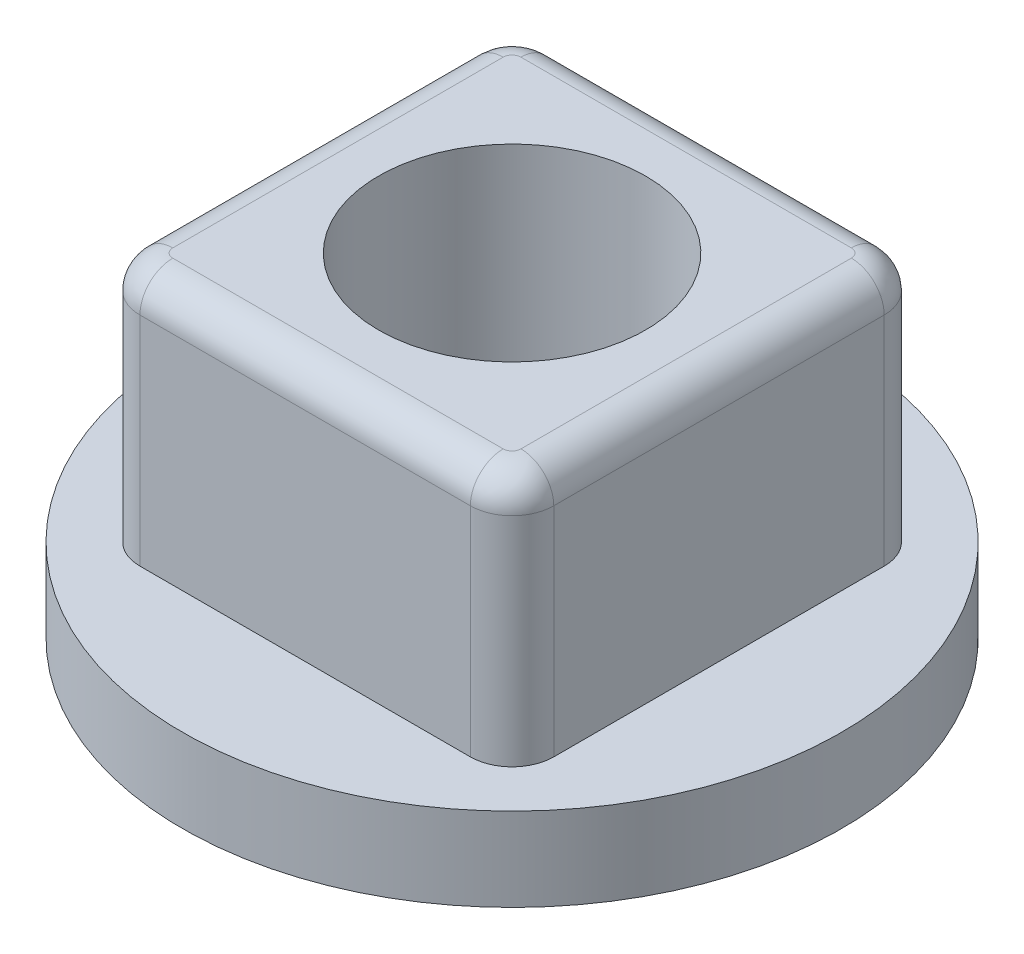
ISO-10303-21;
HEADER;
FILE_DESCRIPTION(('STEP AP214'),'2;1');
FILE_NAME('part.step','',(''),(''),'','','');
FILE_SCHEMA(('AUTOMOTIVE_DESIGN { 1 0 10303 214 1 1 1 1 }'));
ENDSEC;
DATA;
#1=APPLICATION_CONTEXT('core data for automotive mechanical design processes');
#2=APPLICATION_PROTOCOL_DEFINITION('international standard','automotive_design',2000,#1);
#3=PRODUCT_CONTEXT('',#1,'mechanical');
#4=PRODUCT('Part','Part','',(#3));
#5=PRODUCT_RELATED_PRODUCT_CATEGORY('part','',(#4));
#6=PRODUCT_DEFINITION_FORMATION('','',#4);
#7=PRODUCT_DEFINITION_CONTEXT('part definition',#1,'design');
#8=PRODUCT_DEFINITION('design','',#6,#7);
#9=PRODUCT_DEFINITION_SHAPE('','',#8);
#10=(LENGTH_UNIT() NAMED_UNIT(*) SI_UNIT(.MILLI.,.METRE.));
#11=(NAMED_UNIT(*) PLANE_ANGLE_UNIT() SI_UNIT($,.RADIAN.));
#12=(NAMED_UNIT(*) SI_UNIT($,.STERADIAN.) SOLID_ANGLE_UNIT());
#13=UNCERTAINTY_MEASURE_WITH_UNIT(LENGTH_MEASURE(1.E-05),#10,'distance_accuracy_value','');
#14=(GEOMETRIC_REPRESENTATION_CONTEXT(3) GLOBAL_UNCERTAINTY_ASSIGNED_CONTEXT((#13)) GLOBAL_UNIT_ASSIGNED_CONTEXT((#10,
#11,#12)) REPRESENTATION_CONTEXT('',''));
#15=CARTESIAN_POINT('',(0.,0.,0.));
#16=DIRECTION('',(0.,0.,1.));
#17=DIRECTION('',(1.,0.,0.));
#18=AXIS2_PLACEMENT_3D('',#15,#16,#17);
#19=CARTESIAN_POINT('',(-2.5146,5.08,2.5146));
#20=DIRECTION('',(0.,-1.,0.));
#21=DIRECTION('',(0.,0.,-1.));
#22=AXIS2_PLACEMENT_3D('',#19,#20,#21);
#23=CYLINDRICAL_SURFACE('',#22,0.635);
#24=DIRECTION('',(0.,1.,0.));
#25=VECTOR('',#24,1.);
#26=CARTESIAN_POINT('',(-3.1496,5.08,2.51459999999995));
#27=LINE('',#26,#25);
#28=CARTESIAN_POINT('',(-3.14960000000036,4.58,2.51460000000302));
#29=VERTEX_POINT('',#28);
#30=CARTESIAN_POINT('',(-3.1496,1.27,2.51459999999997));
#31=VERTEX_POINT('',#30);
#32=EDGE_CURVE('E65',#29,#31,#27,.F.);
#33=ORIENTED_EDGE('',*,*,#32,.T.);
#34=CARTESIAN_POINT('',(-2.5146,1.27,2.5146));
#35=DIRECTION('',(0.,-1.,0.));
#36=DIRECTION('',(0.,0.,-1.));
#37=AXIS2_PLACEMENT_3D('',#34,#35,#36);
#38=CIRCLE('',#37,0.635);
#39=CARTESIAN_POINT('',(-2.5146,1.27,3.1496));
#40=VERTEX_POINT('',#39);
#41=EDGE_CURVE('E17',#31,#40,#38,.F.);
#42=ORIENTED_EDGE('',*,*,#41,.T.);
#43=DIRECTION('',(0.,1.,0.));
#44=VECTOR('',#43,1.);
#45=CARTESIAN_POINT('',(-2.5146,5.08,3.1496));
#46=LINE('',#45,#44);
#47=CARTESIAN_POINT('',(-2.5146,4.58,3.14959999999967));
#48=VERTEX_POINT('',#47);
#49=EDGE_CURVE('E62',#40,#48,#46,.T.);
#50=ORIENTED_EDGE('',*,*,#49,.T.);
#51=CARTESIAN_POINT('',(-2.51460000000003,4.58000000000001,2.51459999999865));
#52=DIRECTION('',(0.,-1.,0.));
#53=DIRECTION('',(0.,0.,-1.));
#54=AXIS2_PLACEMENT_3D('',#51,#52,#53);
#55=CIRCLE('',#54,0.635000000000685);
#56=EDGE_CURVE('E214',#29,#48,#55,.F.);
#57=ORIENTED_EDGE('',*,*,#56,.F.);
#58=EDGE_LOOP('',(#33,#42,#50,#57));
#59=FACE_BOUND('',#58,.T.);
#60=ADVANCED_FACE('F14',(#59),#23,.T.);
#61=CARTESIAN_POINT('',(-2.5146,5.08,-2.5146));
#62=DIRECTION('',(0.,-1.,0.));
#63=DIRECTION('',(0.,0.,-1.));
#64=AXIS2_PLACEMENT_3D('',#61,#62,#63);
#65=CYLINDRICAL_SURFACE('',#64,0.635);
#66=DIRECTION('',(0.,1.,0.));
#67=VECTOR('',#66,1.);
#68=CARTESIAN_POINT('',(-2.51459999999995,5.08,-3.1496));
#69=LINE('',#68,#67);
#70=CARTESIAN_POINT('',(-2.51460000000237,4.58000000000076,-3.1496));
#71=VERTEX_POINT('',#70);
#72=CARTESIAN_POINT('',(-2.51459999999997,1.27,-3.1496));
#73=VERTEX_POINT('',#72);
#74=EDGE_CURVE('E182',#71,#73,#69,.F.);
#75=ORIENTED_EDGE('',*,*,#74,.T.);
#76=CARTESIAN_POINT('',(-2.5146,1.27,-2.5146));
#77=DIRECTION('',(0.,-1.,0.));
#78=DIRECTION('',(0.,0.,-1.));
#79=AXIS2_PLACEMENT_3D('',#76,#77,#78);
#80=CIRCLE('',#79,0.635);
#81=CARTESIAN_POINT('',(-3.1496,1.27,-2.5146));
#82=VERTEX_POINT('',#81);
#83=EDGE_CURVE('E67',#73,#82,#80,.F.);
#84=ORIENTED_EDGE('',*,*,#83,.T.);
#85=DIRECTION('',(0.,1.,0.));
#86=VECTOR('',#85,1.);
#87=CARTESIAN_POINT('',(-3.1496,5.08,-2.5146));
#88=LINE('',#87,#86);
#89=CARTESIAN_POINT('',(-3.14959999999983,4.58,-2.5146));
#90=VERTEX_POINT('',#89);
#91=EDGE_CURVE('E189',#82,#90,#88,.T.);
#92=ORIENTED_EDGE('',*,*,#91,.T.);
#93=CARTESIAN_POINT('',(-2.51459999999865,4.58000000000001,-2.51460000000003));
#94=DIRECTION('',(0.,-1.,0.));
#95=DIRECTION('',(1.,0.,0.));
#96=AXIS2_PLACEMENT_3D('',#93,#94,#95);
#97=CIRCLE('',#96,0.635000000000685);
#98=EDGE_CURVE('E224',#71,#90,#97,.F.);
#99=ORIENTED_EDGE('',*,*,#98,.F.);
#100=EDGE_LOOP('',(#75,#84,#92,#99));
#101=FACE_BOUND('',#100,.T.);
#102=ADVANCED_FACE('F335',(#101),#65,.T.);
#103=CARTESIAN_POINT('',(2.5146,5.08,2.5146));
#104=DIRECTION('',(0.,-1.,0.));
#105=DIRECTION('',(0.,0.,-1.));
#106=AXIS2_PLACEMENT_3D('',#103,#104,#105);
#107=CYLINDRICAL_SURFACE('',#106,0.635);
#108=DIRECTION('',(0.,1.,0.));
#109=VECTOR('',#108,1.);
#110=CARTESIAN_POINT('',(2.51459999999995,5.08,3.1496));
#111=LINE('',#110,#109);
#112=CARTESIAN_POINT('',(2.51460000000302,4.58,3.14960000000036));
#113=VERTEX_POINT('',#112);
#114=CARTESIAN_POINT('',(2.51459999999997,1.27,3.1496));
#115=VERTEX_POINT('',#114);
#116=EDGE_CURVE('E192',#113,#115,#111,.F.);
#117=ORIENTED_EDGE('',*,*,#116,.T.);
#118=CARTESIAN_POINT('',(2.5146,1.27,2.5146));
#119=DIRECTION('',(0.,-1.,0.));
#120=DIRECTION('',(0.,0.,-1.));
#121=AXIS2_PLACEMENT_3D('',#118,#119,#120);
#122=CIRCLE('',#121,0.635);
#123=CARTESIAN_POINT('',(3.1496,1.27,2.5146));
#124=VERTEX_POINT('',#123);
#125=EDGE_CURVE('E79',#115,#124,#122,.F.);
#126=ORIENTED_EDGE('',*,*,#125,.T.);
#127=DIRECTION('',(0.,1.,0.));
#128=VECTOR('',#127,1.);
#129=CARTESIAN_POINT('',(3.1496,5.08,2.5146));
#130=LINE('',#129,#128);
#131=CARTESIAN_POINT('',(3.14959999999983,4.58,2.51460000000015));
#132=VERTEX_POINT('',#131);
#133=EDGE_CURVE('E179',#124,#132,#130,.T.);
#134=ORIENTED_EDGE('',*,*,#133,.T.);
#135=CARTESIAN_POINT('',(2.51459999999865,4.58000000000001,2.51460000000003));
#136=DIRECTION('',(0.,-1.,0.));
#137=DIRECTION('',(1.,0.,0.));
#138=AXIS2_PLACEMENT_3D('',#135,#136,#137);
#139=CIRCLE('',#138,0.635000000000685);
#140=EDGE_CURVE('E283',#113,#132,#139,.F.);
#141=ORIENTED_EDGE('',*,*,#140,.F.);
#142=EDGE_LOOP('',(#117,#126,#134,#141));
#143=FACE_BOUND('',#142,.T.);
#144=ADVANCED_FACE('F366',(#143),#107,.T.);
#145=CARTESIAN_POINT('',(2.5146,5.08,-2.5146));
#146=DIRECTION('',(0.,-1.,0.));
#147=DIRECTION('',(0.,0.,-1.));
#148=AXIS2_PLACEMENT_3D('',#145,#146,#147);
#149=CYLINDRICAL_SURFACE('',#148,0.635);
#150=DIRECTION('',(0.,1.,0.));
#151=VECTOR('',#150,1.);
#152=CARTESIAN_POINT('',(3.1496,5.08,-2.51459999999997));
#153=LINE('',#152,#151);
#154=CARTESIAN_POINT('',(3.14960000000036,4.58,-2.51460000000303));
#155=VERTEX_POINT('',#154);
#156=CARTESIAN_POINT('',(3.1496,1.27,-2.51459999999999));
#157=VERTEX_POINT('',#156);
#158=EDGE_CURVE('E168',#155,#157,#153,.F.);
#159=ORIENTED_EDGE('',*,*,#158,.T.);
#160=CARTESIAN_POINT('',(2.5146,1.27,-2.5146));
#161=DIRECTION('',(0.,-1.,0.));
#162=DIRECTION('',(0.,0.,-1.));
#163=AXIS2_PLACEMENT_3D('',#160,#161,#162);
#164=CIRCLE('',#163,0.635);
#165=CARTESIAN_POINT('',(2.5146,1.27,-3.1496));
#166=VERTEX_POINT('',#165);
#167=EDGE_CURVE('E32',#157,#166,#164,.F.);
#168=ORIENTED_EDGE('',*,*,#167,.T.);
#169=DIRECTION('',(0.,1.,0.));
#170=VECTOR('',#169,1.);
#171=CARTESIAN_POINT('',(2.5146,5.08,-3.1496));
#172=LINE('',#171,#170);
#173=CARTESIAN_POINT('',(2.51460000000001,4.58,-3.14959999999983));
#174=VERTEX_POINT('',#173);
#175=EDGE_CURVE('E183',#166,#174,#172,.T.);
#176=ORIENTED_EDGE('',*,*,#175,.T.);
#177=CARTESIAN_POINT('',(2.51460000000003,4.58000000000001,-2.51459999999865));
#178=DIRECTION('',(0.,-1.,0.));
#179=DIRECTION('',(0.,0.,-1.));
#180=AXIS2_PLACEMENT_3D('',#177,#178,#179);
#181=CIRCLE('',#180,0.635000000000685);
#182=EDGE_CURVE('E253',#155,#174,#181,.F.);
#183=ORIENTED_EDGE('',*,*,#182,.F.);
#184=EDGE_LOOP('',(#159,#168,#176,#183));
#185=FACE_BOUND('',#184,.T.);
#186=ADVANCED_FACE('F379',(#185),#149,.T.);
#187=CARTESIAN_POINT('',(2.538898108304,4.58,2.6496));
#188=DIRECTION('',(-1.,0.,0.));
#189=DIRECTION('',(0.,0.,1.));
#190=AXIS2_PLACEMENT_3D('',#187,#188,#189);
#191=CYLINDRICAL_SURFACE('',#190,0.5);
#192=CARTESIAN_POINT('',(2.51460000000023,4.58000000000151,2.64960000000213));
#193=DIRECTION('',(-1.,0.,1.17253486400112E-11));
#194=DIRECTION('',(1.17253486400112E-11,0.,1.));
#195=AXIS2_PLACEMENT_3D('',#192,#193,#194);
#196=CIRCLE('',#195,0.499999999998586);
#197=CARTESIAN_POINT('',(2.51460000000024,5.08000000000005,2.64959999798593));
#198=VERTEX_POINT('',#197);
#199=EDGE_CURVE('E167',#198,#113,#196,.F.);
#200=ORIENTED_EDGE('',*,*,#199,.F.);
#201=DIRECTION('',(1.,0.,0.));
#202=VECTOR('',#201,1.);
#203=CARTESIAN_POINT('',(-3.1496,5.08,2.6496));
#204=LINE('',#203,#202);
#205=CARTESIAN_POINT('',(-2.51460000000002,5.08000000000005,2.64960000000019));
#206=VERTEX_POINT('',#205);
#207=EDGE_CURVE('E154',#206,#198,#204,.T.);
#208=ORIENTED_EDGE('',*,*,#207,.F.);
#209=CARTESIAN_POINT('',(-2.51460000000002,4.58000000000152,2.64960000000074));
#210=DIRECTION('',(-1.,0.,0.));
#211=DIRECTION('',(0.,0.,1.));
#212=AXIS2_PLACEMENT_3D('',#209,#210,#211);
#213=CIRCLE('',#212,0.499999999998586);
#214=EDGE_CURVE('E76',#48,#206,#213,.T.);
#215=ORIENTED_EDGE('',*,*,#214,.F.);
#216=DIRECTION('',(-1.,0.,0.));
#217=VECTOR('',#216,1.);
#218=CARTESIAN_POINT('',(-3.1496,4.58,3.1496));
#219=LINE('',#218,#217);
#220=EDGE_CURVE('E74',#48,#113,#219,.F.);
#221=ORIENTED_EDGE('',*,*,#220,.T.);
#222=EDGE_LOOP('',(#200,#208,#215,#221));
#223=FACE_BOUND('',#222,.T.);
#224=ADVANCED_FACE('F165',(#223),#191,.T.);
#225=CARTESIAN_POINT('',(2.64960000000074,4.58000000000151,2.51460000000003));
#226=DIRECTION('',(0.,0.,1.));
#227=DIRECTION('',(1.,0.,0.));
#228=AXIS2_PLACEMENT_3D('',#225,#226,#227);
#229=CIRCLE('',#228,0.499999999998586);
#230=TRIMMED_CURVE('',#229,(PARAMETER_VALUE(-1.84418935826752)),
(PARAMETER_VALUE(1.84418935826752)),.T.,.PARAMETER.);
#231=CARTESIAN_POINT('',(2.51459999999865,4.58000000000152,2.51460000000003));
#232=DIRECTION('',(0.,-1.,0.));
#233=AXIS1_PLACEMENT('',#231,#232);
#234=SURFACE_OF_REVOLUTION('',#230,#233);
#235=CARTESIAN_POINT('',(2.6496,4.58,2.51460000000056));
#236=DIRECTION('',(0.,0.,1.));
#237=DIRECTION('',(1.,0.,0.));
#238=AXIS2_PLACEMENT_3D('',#235,#236,#237);
#239=CIRCLE('',#238,0.5);
#240=CARTESIAN_POINT('',(2.64959999764931,5.08000000000002,2.51460000000043));
#241=VERTEX_POINT('',#240);
#242=EDGE_CURVE('E278',#241,#132,#239,.F.);
#243=ORIENTED_EDGE('',*,*,#242,.F.);
#244=CARTESIAN_POINT('',(2.51459999999865,5.0800000000001,2.51460000000004));
#245=DIRECTION('',(0.,-1.,0.));
#246=DIRECTION('',(1.,0.,0.));
#247=AXIS2_PLACEMENT_3D('',#244,#245,#246);
#248=CIRCLE('',#247,0.134999998658406);
#249=EDGE_CURVE('E97',#198,#241,#248,.F.);
#250=ORIENTED_EDGE('',*,*,#249,.F.);
#251=ORIENTED_EDGE('',*,*,#199,.T.);
#252=ORIENTED_EDGE('',*,*,#140,.T.);
#253=EDGE_LOOP('',(#243,#250,#251,#252));
#254=FACE_BOUND('',#253,.T.);
#255=ADVANCED_FACE('F289',(#254),#234,.F.);
#256=CARTESIAN_POINT('',(2.6496,4.58,-2.538898108304));
#257=DIRECTION('',(0.,0.,1.));
#258=DIRECTION('',(1.,0.,0.));
#259=AXIS2_PLACEMENT_3D('',#256,#257,#258);
#260=CYLINDRICAL_SURFACE('',#259,0.5);
#261=CARTESIAN_POINT('',(2.64960000000213,4.58000000000151,-2.51460000000023));
#262=DIRECTION('',(1.17253486400112E-11,0.,1.));
#263=DIRECTION('',(1.,0.,-1.17253486400112E-11));
#264=AXIS2_PLACEMENT_3D('',#261,#262,#263);
#265=CIRCLE('',#264,0.499999999998586);
#266=CARTESIAN_POINT('',(2.64959999865759,5.08000000000005,-2.51460000000024));
#267=VERTEX_POINT('',#266);
#268=EDGE_CURVE('E270',#267,#155,#265,.F.);
#269=ORIENTED_EDGE('',*,*,#268,.F.);
#270=DIRECTION('',(0.,0.,1.));
#271=VECTOR('',#270,1.);
#272=CARTESIAN_POINT('',(2.64959999731337,5.08,3.1496));
#273=LINE('',#272,#271);
#274=EDGE_CURVE('E170',#241,#267,#273,.F.);
#275=ORIENTED_EDGE('',*,*,#274,.F.);
#276=ORIENTED_EDGE('',*,*,#242,.T.);
#277=DIRECTION('',(0.,0.,1.));
#278=VECTOR('',#277,1.);
#279=CARTESIAN_POINT('',(3.1496,4.58,-3.1496));
#280=LINE('',#279,#278);
#281=EDGE_CURVE('E171',#132,#155,#280,.F.);
#282=ORIENTED_EDGE('',*,*,#281,.T.);
#283=EDGE_LOOP('',(#269,#275,#276,#282));
#284=FACE_BOUND('',#283,.T.);
#285=ADVANCED_FACE('F264',(#284),#260,.T.);
#286=CARTESIAN_POINT('',(2.51460000000003,4.58000000000151,-2.64960000000074));
#287=DIRECTION('',(1.,0.,0.));
#288=DIRECTION('',(0.,0.,-1.));
#289=AXIS2_PLACEMENT_3D('',#286,#287,#288);
#290=CIRCLE('',#289,0.499999999998586);
#291=TRIMMED_CURVE('',#290,(PARAMETER_VALUE(-1.84418935826752)),
(PARAMETER_VALUE(1.84418935826752)),.T.,.PARAMETER.);
#292=CARTESIAN_POINT('',(2.51460000000003,4.58000000000152,-2.51459999999865));
#293=DIRECTION('',(0.,-1.,0.));
#294=AXIS1_PLACEMENT('',#292,#293);
#295=SURFACE_OF_REVOLUTION('',#291,#294);
#296=CARTESIAN_POINT('',(2.5146,4.58,-2.6496));
#297=DIRECTION('',(1.,0.,0.));
#298=DIRECTION('',(0.,0.,-1.));
#299=AXIS2_PLACEMENT_3D('',#296,#297,#298);
#300=CIRCLE('',#299,0.5);
#301=CARTESIAN_POINT('',(2.51460000000001,5.08000000000002,-2.64959999932845));
#302=VERTEX_POINT('',#301);
#303=EDGE_CURVE('E248',#302,#174,#300,.F.);
#304=ORIENTED_EDGE('',*,*,#303,.F.);
#305=CARTESIAN_POINT('',(2.51460000000004,5.0800000000001,-2.51459999999865));
#306=DIRECTION('',(0.,-1.,0.));
#307=DIRECTION('',(0.,0.,-1.));
#308=AXIS2_PLACEMENT_3D('',#305,#306,#307);
#309=CIRCLE('',#308,0.135000000001723);
#310=EDGE_CURVE('E386',#267,#302,#309,.F.);
#311=ORIENTED_EDGE('',*,*,#310,.F.);
#312=ORIENTED_EDGE('',*,*,#268,.T.);
#313=ORIENTED_EDGE('',*,*,#182,.T.);
#314=EDGE_LOOP('',(#304,#311,#312,#313));
#315=FACE_BOUND('',#314,.T.);
#316=ADVANCED_FACE('F260',(#315),#295,.F.);
#317=CARTESIAN_POINT('',(-2.538898108304,4.58,-2.6496));
#318=DIRECTION('',(1.,0.,0.));
#319=DIRECTION('',(0.,0.,-1.));
#320=AXIS2_PLACEMENT_3D('',#317,#318,#319);
#321=CYLINDRICAL_SURFACE('',#320,0.5);
#322=CARTESIAN_POINT('',(-2.51460000000023,4.58000000000152,-2.64960000000213));
#323=DIRECTION('',(1.,0.,-1.17259151939009E-11));
#324=DIRECTION('',(-1.17259151939009E-11,0.,-1.));
#325=AXIS2_PLACEMENT_3D('',#322,#323,#324);
#326=CIRCLE('',#325,0.499999999998586);
#327=CARTESIAN_POINT('',(-2.51460000000024,5.08000000000005,-2.64959999865759));
#328=VERTEX_POINT('',#327);
#329=EDGE_CURVE('E240',#328,#71,#326,.F.);
#330=ORIENTED_EDGE('',*,*,#329,.F.);
#331=DIRECTION('',(1.,0.,0.));
#332=VECTOR('',#331,1.);
#333=CARTESIAN_POINT('',(-3.1496,5.08,-2.6496));
#334=LINE('',#333,#332);
#335=EDGE_CURVE('E385',#302,#328,#334,.F.);
#336=ORIENTED_EDGE('',*,*,#335,.F.);
#337=ORIENTED_EDGE('',*,*,#303,.T.);
#338=DIRECTION('',(1.,0.,0.));
#339=VECTOR('',#338,1.);
#340=CARTESIAN_POINT('',(-3.1496,4.58,-3.1496));
#341=LINE('',#340,#339);
#342=EDGE_CURVE('E186',#174,#71,#341,.F.);
#343=ORIENTED_EDGE('',*,*,#342,.T.);
#344=EDGE_LOOP('',(#330,#336,#337,#343));
#345=FACE_BOUND('',#344,.T.);
#346=ADVANCED_FACE('F234',(#345),#321,.T.);
#347=CARTESIAN_POINT('',(-2.37959999999655,4.58000000000152,-2.51460000000003));
#348=DIRECTION('',(0.,0.,1.));
#349=DIRECTION('',(1.,0.,0.));
#350=AXIS2_PLACEMENT_3D('',#347,#348,#349);
#351=CIRCLE('',#350,0.499999999998586);
#352=TRIMMED_CURVE('',#351,(PARAMETER_VALUE(-1.84418935826752)),
(PARAMETER_VALUE(1.84418935826752)),.T.,.PARAMETER.);
#353=CARTESIAN_POINT('',(-2.51459999999865,4.58000000000152,-2.51460000000003));
#354=DIRECTION('',(0.,-1.,0.));
#355=AXIS1_PLACEMENT('',#353,#354);
#356=SURFACE_OF_REVOLUTION('',#352,#355);
#357=CARTESIAN_POINT('',(-2.6496,4.58,-2.5146));
#358=DIRECTION('',(0.,0.,-1.));
#359=DIRECTION('',(-1.,0.,0.));
#360=AXIS2_PLACEMENT_3D('',#357,#358,#359);
#361=CIRCLE('',#360,0.5);
#362=CARTESIAN_POINT('',(-2.64959999932845,5.08000000000002,-2.51460000000001));
#363=VERTEX_POINT('',#362);
#364=EDGE_CURVE('E219',#363,#90,#361,.F.);
#365=ORIENTED_EDGE('',*,*,#364,.F.);
#366=CARTESIAN_POINT('',(-2.51459999999865,5.0800000000001,-2.51460000000004));
#367=DIRECTION('',(0.,-1.,0.));
#368=DIRECTION('',(-1.,0.,0.));
#369=AXIS2_PLACEMENT_3D('',#366,#367,#368);
#370=CIRCLE('',#369,0.135000000001722);
#371=EDGE_CURVE('E140',#328,#363,#370,.F.);
#372=ORIENTED_EDGE('',*,*,#371,.F.);
#373=ORIENTED_EDGE('',*,*,#329,.T.);
#374=ORIENTED_EDGE('',*,*,#98,.T.);
#375=EDGE_LOOP('',(#365,#372,#373,#374));
#376=FACE_BOUND('',#375,.T.);
#377=ADVANCED_FACE('F230',(#376),#356,.F.);
#378=CARTESIAN_POINT('',(-2.6496,4.58,2.538898108304));
#379=DIRECTION('',(0.,0.,-1.));
#380=DIRECTION('',(-1.,0.,0.));
#381=AXIS2_PLACEMENT_3D('',#378,#379,#380);
#382=CYLINDRICAL_SURFACE('',#381,0.5);
#383=CARTESIAN_POINT('',(-2.64960000000213,4.58000000000152,2.51460000000023));
#384=DIRECTION('',(-1.17259151939009E-11,0.,-1.));
#385=DIRECTION('',(-1.,0.,1.17259151939009E-11));
#386=AXIS2_PLACEMENT_3D('',#383,#384,#385);
#387=CIRCLE('',#386,0.499999999998586);
#388=CARTESIAN_POINT('',(-2.64959999865759,5.08000000000005,2.51460000000024));
#389=VERTEX_POINT('',#388);
#390=EDGE_CURVE('E217',#389,#29,#387,.F.);
#391=ORIENTED_EDGE('',*,*,#390,.F.);
#392=DIRECTION('',(0.,0.,1.));
#393=VECTOR('',#392,1.);
#394=CARTESIAN_POINT('',(-2.6496,5.08,3.1496));
#395=LINE('',#394,#393);
#396=EDGE_CURVE('E87',#363,#389,#395,.T.);
#397=ORIENTED_EDGE('',*,*,#396,.F.);
#398=ORIENTED_EDGE('',*,*,#364,.T.);
#399=DIRECTION('',(0.,0.,-1.));
#400=VECTOR('',#399,1.);
#401=CARTESIAN_POINT('',(-3.1496,4.58,-3.1496));
#402=LINE('',#401,#400);
#403=EDGE_CURVE('E188',#90,#29,#402,.F.);
#404=ORIENTED_EDGE('',*,*,#403,.T.);
#405=EDGE_LOOP('',(#391,#397,#398,#404));
#406=FACE_BOUND('',#405,.T.);
#407=ADVANCED_FACE('F202',(#406),#382,.T.);
#408=CARTESIAN_POINT('',(-2.51460000000003,4.58000000000152,2.37959999999655));
#409=DIRECTION('',(1.,0.,0.));
#410=DIRECTION('',(0.,0.,-1.));
#411=AXIS2_PLACEMENT_3D('',#408,#409,#410);
#412=CIRCLE('',#411,0.499999999998586);
#413=TRIMMED_CURVE('',#412,(PARAMETER_VALUE(-1.84418935826752)),
(PARAMETER_VALUE(1.84418935826752)),.T.,.PARAMETER.);
#414=CARTESIAN_POINT('',(-2.51460000000003,4.58000000000152,2.51459999999865));
#415=DIRECTION('',(0.,-1.,0.));
#416=AXIS1_PLACEMENT('',#414,#415);
#417=SURFACE_OF_REVOLUTION('',#413,#416);
#418=ORIENTED_EDGE('',*,*,#214,.T.);
#419=CARTESIAN_POINT('',(-2.51460000000004,5.0800000000001,2.51459999999865));
#420=DIRECTION('',(0.,-1.,0.));
#421=DIRECTION('',(0.,0.,1.));
#422=AXIS2_PLACEMENT_3D('',#419,#420,#421);
#423=CIRCLE('',#422,0.135000000001722);
#424=EDGE_CURVE('E82',#389,#206,#423,.F.);
#425=ORIENTED_EDGE('',*,*,#424,.F.);
#426=ORIENTED_EDGE('',*,*,#390,.T.);
#427=ORIENTED_EDGE('',*,*,#56,.T.);
#428=EDGE_LOOP('',(#418,#425,#426,#427));
#429=FACE_BOUND('',#428,.T.);
#430=ADVANCED_FACE('F197',(#429),#417,.F.);
#431=CARTESIAN_POINT('',(-3.1496,5.08,3.1496));
#432=DIRECTION('',(0.,0.,-1.));
#433=DIRECTION('',(-1.,0.,0.));
#434=AXIS2_PLACEMENT_3D('',#431,#432,#433);
#435=PLANE('',#434);
#436=ORIENTED_EDGE('',*,*,#116,.F.);
#437=ORIENTED_EDGE('',*,*,#220,.F.);
#438=ORIENTED_EDGE('',*,*,#49,.F.);
#439=DIRECTION('',(1.,0.,0.));
#440=VECTOR('',#439,1.);
#441=CARTESIAN_POINT('',(0.,1.27,3.1496));
#442=LINE('',#441,#440);
#443=EDGE_CURVE('E72',#115,#40,#442,.F.);
#444=ORIENTED_EDGE('',*,*,#443,.F.);
#445=EDGE_LOOP('',(#436,#437,#438,#444));
#446=FACE_BOUND('',#445,.T.);
#447=ADVANCED_FACE('F71',(#446),#435,.F.);
#448=CARTESIAN_POINT('',(-3.1496,5.08,-3.1496));
#449=DIRECTION('',(1.,0.,0.));
#450=DIRECTION('',(0.,0.,-1.));
#451=AXIS2_PLACEMENT_3D('',#448,#449,#450);
#452=PLANE('',#451);
#453=ORIENTED_EDGE('',*,*,#32,.F.);
#454=ORIENTED_EDGE('',*,*,#403,.F.);
#455=ORIENTED_EDGE('',*,*,#91,.F.);
#456=DIRECTION('',(0.,0.,1.));
#457=VECTOR('',#456,1.);
#458=CARTESIAN_POINT('',(-3.1496,1.27,0.));
#459=LINE('',#458,#457);
#460=EDGE_CURVE('E81',#31,#82,#459,.F.);
#461=ORIENTED_EDGE('',*,*,#460,.F.);
#462=EDGE_LOOP('',(#453,#454,#455,#461));
#463=FACE_BOUND('',#462,.T.);
#464=ADVANCED_FACE('F342',(#463),#452,.F.);
#465=CARTESIAN_POINT('',(-3.1496,5.08,-3.1496));
#466=DIRECTION('',(0.,0.,1.));
#467=DIRECTION('',(1.,0.,0.));
#468=AXIS2_PLACEMENT_3D('',#465,#466,#467);
#469=PLANE('',#468);
#470=ORIENTED_EDGE('',*,*,#74,.F.);
#471=ORIENTED_EDGE('',*,*,#342,.F.);
#472=ORIENTED_EDGE('',*,*,#175,.F.);
#473=DIRECTION('',(1.,0.,0.));
#474=VECTOR('',#473,1.);
#475=CARTESIAN_POINT('',(0.,1.27,-3.1496));
#476=LINE('',#475,#474);
#477=EDGE_CURVE('E84',#73,#166,#476,.T.);
#478=ORIENTED_EDGE('',*,*,#477,.F.);
#479=EDGE_LOOP('',(#470,#471,#472,#478));
#480=FACE_BOUND('',#479,.T.);
#481=ADVANCED_FACE('F375',(#480),#469,.F.);
#482=CARTESIAN_POINT('',(3.1496,5.08,-3.1496));
#483=DIRECTION('',(-1.,0.,0.));
#484=DIRECTION('',(0.,0.,1.));
#485=AXIS2_PLACEMENT_3D('',#482,#483,#484);
#486=PLANE('',#485);
#487=ORIENTED_EDGE('',*,*,#158,.F.);
#488=ORIENTED_EDGE('',*,*,#281,.F.);
#489=ORIENTED_EDGE('',*,*,#133,.F.);
#490=DIRECTION('',(0.,0.,1.));
#491=VECTOR('',#490,1.);
#492=CARTESIAN_POINT('',(3.1496,1.27,0.));
#493=LINE('',#492,#491);
#494=EDGE_CURVE('E329',#157,#124,#493,.T.);
#495=ORIENTED_EDGE('',*,*,#494,.F.);
#496=EDGE_LOOP('',(#487,#488,#489,#495));
#497=FACE_BOUND('',#496,.T.);
#498=ADVANCED_FACE('F115',(#497),#486,.F.);
#499=CARTESIAN_POINT('',(-3.1496,5.08,3.1496));
#500=DIRECTION('',(0.,1.,0.));
#501=DIRECTION('',(0.,0.,1.));
#502=AXIS2_PLACEMENT_3D('',#499,#500,#501);
#503=PLANE('',#502);
#504=ORIENTED_EDGE('',*,*,#396,.T.);
#505=ORIENTED_EDGE('',*,*,#424,.T.);
#506=ORIENTED_EDGE('',*,*,#207,.T.);
#507=ORIENTED_EDGE('',*,*,#249,.T.);
#508=ORIENTED_EDGE('',*,*,#274,.T.);
#509=ORIENTED_EDGE('',*,*,#310,.T.);
#510=ORIENTED_EDGE('',*,*,#335,.T.);
#511=ORIENTED_EDGE('',*,*,#371,.T.);
#512=EDGE_LOOP('',(#504,#505,#506,#507,#508,#509,#510,#511));
#513=FACE_BOUND('',#512,.T.);
#514=CARTESIAN_POINT('',(0.,5.08,0.));
#515=DIRECTION('',(0.,-1.,0.));
#516=DIRECTION('',(0.,0.,-1.));
#517=AXIS2_PLACEMENT_3D('',#514,#515,#516);
#518=CIRCLE('',#517,2.032);
#519=CARTESIAN_POINT('',(0.,5.08,-2.032));
#520=VERTEX_POINT('',#519);
#521=EDGE_CURVE('E326',#520,#520,#518,.T.);
#522=ORIENTED_EDGE('',*,*,#521,.T.);
#523=EDGE_LOOP('',(#522));
#524=FACE_BOUND('',#523,.T.);
#525=ADVANCED_FACE('F105',(#513,#524),#503,.T.);
#526=CARTESIAN_POINT('',(0.,1.27,0.));
#527=DIRECTION('',(0.,1.,0.));
#528=DIRECTION('',(0.,0.,1.));
#529=AXIS2_PLACEMENT_3D('',#526,#527,#528);
#530=PLANE('',#529);
#531=CARTESIAN_POINT('',(0.,1.27,0.));
#532=DIRECTION('',(0.,-1.,0.));
#533=DIRECTION('',(0.,0.,-1.));
#534=AXIS2_PLACEMENT_3D('',#531,#532,#533);
#535=CIRCLE('',#534,5.0165);
#536=CARTESIAN_POINT('',(0.,1.27,-5.0165));
#537=VERTEX_POINT('',#536);
#538=EDGE_CURVE('E323',#537,#537,#535,.T.);
#539=ORIENTED_EDGE('',*,*,#538,.F.);
#540=EDGE_LOOP('',(#539));
#541=FACE_BOUND('',#540,.T.);
#542=ORIENTED_EDGE('',*,*,#167,.F.);
#543=ORIENTED_EDGE('',*,*,#494,.T.);
#544=ORIENTED_EDGE('',*,*,#125,.F.);
#545=ORIENTED_EDGE('',*,*,#443,.T.);
#546=ORIENTED_EDGE('',*,*,#41,.F.);
#547=ORIENTED_EDGE('',*,*,#460,.T.);
#548=ORIENTED_EDGE('',*,*,#83,.F.);
#549=ORIENTED_EDGE('',*,*,#477,.T.);
#550=EDGE_LOOP('',(#542,#543,#544,#545,#546,#547,#548,#549));
#551=FACE_BOUND('',#550,.T.);
#552=ADVANCED_FACE('F78',(#541,#551),#530,.T.);
#553=CARTESIAN_POINT('',(0.,0.,0.));
#554=DIRECTION('',(0.,-1.,0.));
#555=DIRECTION('',(0.,0.,-1.));
#556=AXIS2_PLACEMENT_3D('',#553,#554,#555);
#557=CYLINDRICAL_SURFACE('',#556,2.032);
#558=ORIENTED_EDGE('',*,*,#521,.F.);
#559=EDGE_LOOP('',(#558));
#560=FACE_BOUND('',#559,.T.);
#561=CARTESIAN_POINT('',(0.,0.,0.));
#562=DIRECTION('',(0.,-1.,0.));
#563=DIRECTION('',(0.,0.,-1.));
#564=AXIS2_PLACEMENT_3D('',#561,#562,#563);
#565=CIRCLE('',#564,2.032);
#566=CARTESIAN_POINT('',(0.,0.,-2.032));
#567=VERTEX_POINT('',#566);
#568=EDGE_CURVE('E23',#567,#567,#565,.T.);
#569=ORIENTED_EDGE('',*,*,#568,.T.);
#570=EDGE_LOOP('',(#569));
#571=FACE_BOUND('',#570,.T.);
#572=ADVANCED_FACE('F406',(#560,#571),#557,.F.);
#573=CARTESIAN_POINT('',(0.,1.27,0.));
#574=DIRECTION('',(0.,-1.,0.));
#575=DIRECTION('',(0.,0.,-1.));
#576=AXIS2_PLACEMENT_3D('',#573,#574,#575);
#577=CYLINDRICAL_SURFACE('',#576,5.0165);
#578=ORIENTED_EDGE('',*,*,#538,.T.);
#579=EDGE_LOOP('',(#578));
#580=FACE_BOUND('',#579,.T.);
#581=CARTESIAN_POINT('',(0.,0.,0.));
#582=DIRECTION('',(0.,-1.,0.));
#583=DIRECTION('',(0.,0.,-1.));
#584=AXIS2_PLACEMENT_3D('',#581,#582,#583);
#585=CIRCLE('',#584,5.0165);
#586=CARTESIAN_POINT('',(0.,0.,-5.0165));
#587=VERTEX_POINT('',#586);
#588=EDGE_CURVE('E9',#587,#587,#585,.F.);
#589=ORIENTED_EDGE('',*,*,#588,.T.);
#590=EDGE_LOOP('',(#589));
#591=FACE_BOUND('',#590,.T.);
#592=ADVANCED_FACE('F400',(#580,#591),#577,.T.);
#593=CARTESIAN_POINT('',(0.,0.,0.));
#594=DIRECTION('',(0.,1.,0.));
#595=DIRECTION('',(0.,0.,1.));
#596=AXIS2_PLACEMENT_3D('',#593,#594,#595);
#597=PLANE('',#596);
#598=ORIENTED_EDGE('',*,*,#588,.F.);
#599=EDGE_LOOP('',(#598));
#600=FACE_BOUND('',#599,.T.);
#601=ORIENTED_EDGE('',*,*,#568,.F.);
#602=EDGE_LOOP('',(#601));
#603=FACE_BOUND('',#602,.T.);
#604=ADVANCED_FACE('F398',(#600,#603),#597,.F.);
#605=CLOSED_SHELL('',(#60,#102,#144,#186,#224,#255,#285,#316,#346,#377,#407,#430,#447,#464,#481,
#498,#525,#552,#572,#592,#604));
#606=MANIFOLD_SOLID_BREP('B1',#605);
#607=ADVANCED_BREP_SHAPE_REPRESENTATION('',(#18,#606),#14);
#608=SHAPE_DEFINITION_REPRESENTATION(#9,#607);
ENDSEC;
END-ISO-10303-21;
